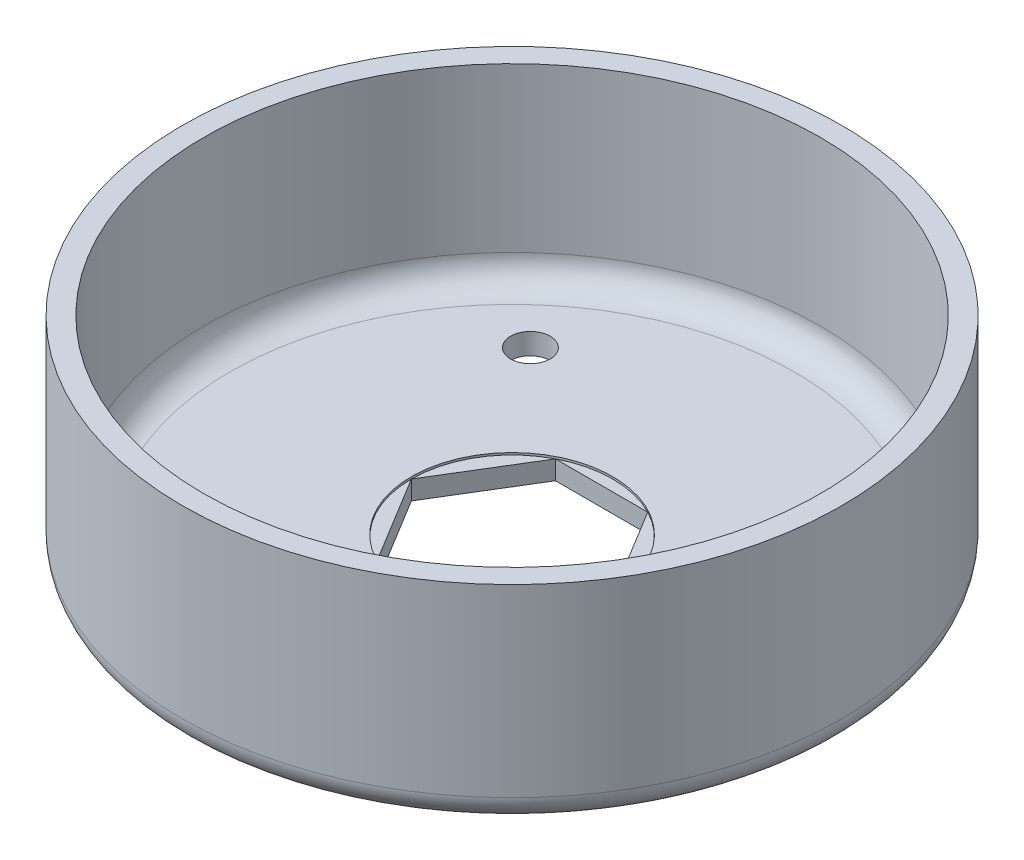
ISO-10303-21;
HEADER;
FILE_DESCRIPTION(('STEP AP214'),'2;1');
FILE_NAME('part.step','',(''),(''),'','','');
FILE_SCHEMA(('AUTOMOTIVE_DESIGN { 1 0 10303 214 1 1 1 1 }'));
ENDSEC;
DATA;
#1=APPLICATION_CONTEXT('core data for automotive mechanical design processes');
#2=APPLICATION_PROTOCOL_DEFINITION('international standard','automotive_design',2000,#1);
#3=PRODUCT_CONTEXT('',#1,'mechanical');
#4=PRODUCT('Part','Part','',(#3));
#5=PRODUCT_RELATED_PRODUCT_CATEGORY('part','',(#4));
#6=PRODUCT_DEFINITION_FORMATION('','',#4);
#7=PRODUCT_DEFINITION_CONTEXT('part definition',#1,'design');
#8=PRODUCT_DEFINITION('design','',#6,#7);
#9=PRODUCT_DEFINITION_SHAPE('','',#8);
#10=(LENGTH_UNIT() NAMED_UNIT(*) SI_UNIT(.MILLI.,.METRE.));
#11=(NAMED_UNIT(*) PLANE_ANGLE_UNIT() SI_UNIT($,.RADIAN.));
#12=(NAMED_UNIT(*) SI_UNIT($,.STERADIAN.) SOLID_ANGLE_UNIT());
#13=UNCERTAINTY_MEASURE_WITH_UNIT(LENGTH_MEASURE(1.E-05),#10,'distance_accuracy_value','');
#14=(GEOMETRIC_REPRESENTATION_CONTEXT(3) GLOBAL_UNCERTAINTY_ASSIGNED_CONTEXT((#13)) GLOBAL_UNIT_ASSIGNED_CONTEXT((#10,
#11,#12)) REPRESENTATION_CONTEXT('',''));
#15=CARTESIAN_POINT('',(0.,0.,0.));
#16=DIRECTION('',(0.,0.,1.));
#17=DIRECTION('',(1.,0.,0.));
#18=AXIS2_PLACEMENT_3D('',#15,#16,#17);
#19=CARTESIAN_POINT('',(-12.1245670639665,0.,0.));
#20=DIRECTION('',(-0.853892202059706,0.,-0.520449908503812));
#21=DIRECTION('',(-0.520449908503812,0.,0.853892202059706));
#22=AXIS2_PLACEMENT_3D('',#19,#20,#21);
#23=PLANE('',#22);
#24=DIRECTION('',(0.520449908503812,0.,-0.853892202059706));
#25=VECTOR('',#24,1.);
#26=CARTESIAN_POINT('',(-12.1245670639665,2.286,0.));
#27=LINE('',#26,#25);
#28=CARTESIAN_POINT('',(-12.1245670639665,2.286,0.));
#29=VERTEX_POINT('',#28);
#30=CARTESIAN_POINT('',(-5.55625,2.286,-10.7765120714507));
#31=VERTEX_POINT('',#30);
#32=EDGE_CURVE('E250',#29,#31,#27,.T.);
#33=ORIENTED_EDGE('',*,*,#32,.F.);
#34=DIRECTION('',(0.,1.,0.));
#35=VECTOR('',#34,1.);
#36=CARTESIAN_POINT('',(-12.1245670639665,0.,0.));
#37=LINE('',#36,#35);
#38=CARTESIAN_POINT('',(-12.1245670639665,0.,0.));
#39=VERTEX_POINT('',#38);
#40=EDGE_CURVE('E125',#39,#29,#37,.T.);
#41=ORIENTED_EDGE('',*,*,#40,.F.);
#42=DIRECTION('',(-0.520449908503812,0.,0.853892202059706));
#43=VECTOR('',#42,1.);
#44=CARTESIAN_POINT('',(-12.1245670639665,0.,0.));
#45=LINE('',#44,#43);
#46=CARTESIAN_POINT('',(-5.55625,0.,-10.7765120714507));
#47=VERTEX_POINT('',#46);
#48=EDGE_CURVE('E235',#47,#39,#45,.T.);
#49=ORIENTED_EDGE('',*,*,#48,.F.);
#50=DIRECTION('',(0.,1.,0.));
#51=VECTOR('',#50,1.);
#52=CARTESIAN_POINT('',(-5.55625,0.,-10.7765120714507));
#53=LINE('',#52,#51);
#54=EDGE_CURVE('E136',#47,#31,#53,.T.);
#55=ORIENTED_EDGE('',*,*,#54,.T.);
#56=EDGE_LOOP('',(#33,#41,#49,#55));
#57=FACE_BOUND('',#56,.T.);
#58=ADVANCED_FACE('F34',(#57),#23,.F.);
#59=CARTESIAN_POINT('',(-5.55625,0.,-10.7765120714507));
#60=DIRECTION('',(0.,0.,-1.));
#61=DIRECTION('',(-1.,0.,0.));
#62=AXIS2_PLACEMENT_3D('',#59,#60,#61);
#63=PLANE('',#62);
#64=DIRECTION('',(1.,0.,0.));
#65=VECTOR('',#64,1.);
#66=CARTESIAN_POINT('',(-5.55625,2.286,-10.7765120714507));
#67=LINE('',#66,#65);
#68=CARTESIAN_POINT('',(5.55625,2.286,-10.7765120714507));
#69=VERTEX_POINT('',#68);
#70=EDGE_CURVE('E245',#31,#69,#67,.T.);
#71=ORIENTED_EDGE('',*,*,#70,.F.);
#72=ORIENTED_EDGE('',*,*,#54,.F.);
#73=DIRECTION('',(-1.,0.,0.));
#74=VECTOR('',#73,1.);
#75=CARTESIAN_POINT('',(-5.55625,0.,-10.7765120714507));
#76=LINE('',#75,#74);
#77=CARTESIAN_POINT('',(5.55625,0.,-10.7765120714507));
#78=VERTEX_POINT('',#77);
#79=EDGE_CURVE('E131',#78,#47,#76,.T.);
#80=ORIENTED_EDGE('',*,*,#79,.F.);
#81=DIRECTION('',(0.,1.,0.));
#82=VECTOR('',#81,1.);
#83=CARTESIAN_POINT('',(5.55625,0.,-10.7765120714507));
#84=LINE('',#83,#82);
#85=EDGE_CURVE('E123',#78,#69,#84,.T.);
#86=ORIENTED_EDGE('',*,*,#85,.T.);
#87=EDGE_LOOP('',(#71,#72,#80,#86));
#88=FACE_BOUND('',#87,.T.);
#89=ADVANCED_FACE('F176',(#88),#63,.F.);
#90=CARTESIAN_POINT('',(5.55625,0.,-10.7765120714507));
#91=DIRECTION('',(0.853892202059706,0.,-0.520449908503812));
#92=DIRECTION('',(-0.520449908503812,0.,-0.853892202059706));
#93=AXIS2_PLACEMENT_3D('',#90,#91,#92);
#94=PLANE('',#93);
#95=DIRECTION('',(0.520449908503812,0.,0.853892202059706));
#96=VECTOR('',#95,1.);
#97=CARTESIAN_POINT('',(5.55625,2.286,-10.7765120714507));
#98=LINE('',#97,#96);
#99=CARTESIAN_POINT('',(12.1245670639665,2.286,0.));
#100=VERTEX_POINT('',#99);
#101=EDGE_CURVE('E96',#69,#100,#98,.T.);
#102=ORIENTED_EDGE('',*,*,#101,.F.);
#103=ORIENTED_EDGE('',*,*,#85,.F.);
#104=DIRECTION('',(-0.520449908503812,0.,-0.853892202059706));
#105=VECTOR('',#104,1.);
#106=CARTESIAN_POINT('',(5.55625,0.,-10.7765120714507));
#107=LINE('',#106,#105);
#108=CARTESIAN_POINT('',(12.1245670639665,0.,0.));
#109=VERTEX_POINT('',#108);
#110=EDGE_CURVE('E237',#109,#78,#107,.T.);
#111=ORIENTED_EDGE('',*,*,#110,.F.);
#112=DIRECTION('',(0.,1.,0.));
#113=VECTOR('',#112,1.);
#114=CARTESIAN_POINT('',(12.1245670639665,0.,0.));
#115=LINE('',#114,#113);
#116=EDGE_CURVE('E121',#109,#100,#115,.T.);
#117=ORIENTED_EDGE('',*,*,#116,.T.);
#118=EDGE_LOOP('',(#102,#103,#111,#117));
#119=FACE_BOUND('',#118,.T.);
#120=ADVANCED_FACE('F182',(#119),#94,.F.);
#121=CARTESIAN_POINT('',(12.1245670639665,0.,0.));
#122=DIRECTION('',(0.853892202059706,0.,0.520449908503812));
#123=DIRECTION('',(0.520449908503812,0.,-0.853892202059706));
#124=AXIS2_PLACEMENT_3D('',#121,#122,#123);
#125=PLANE('',#124);
#126=DIRECTION('',(-0.520449908503812,0.,0.853892202059706));
#127=VECTOR('',#126,1.);
#128=CARTESIAN_POINT('',(12.1245670639665,2.286,0.));
#129=LINE('',#128,#127);
#130=CARTESIAN_POINT('',(5.55625,2.286,10.7765120714507));
#131=VERTEX_POINT('',#130);
#132=EDGE_CURVE('E88',#100,#131,#129,.T.);
#133=ORIENTED_EDGE('',*,*,#132,.F.);
#134=ORIENTED_EDGE('',*,*,#116,.F.);
#135=DIRECTION('',(0.520449908503812,0.,-0.853892202059706));
#136=VECTOR('',#135,1.);
#137=CARTESIAN_POINT('',(12.1245670639665,0.,0.));
#138=LINE('',#137,#136);
#139=CARTESIAN_POINT('',(5.55625,0.,10.7765120714507));
#140=VERTEX_POINT('',#139);
#141=EDGE_CURVE('E120',#140,#109,#138,.T.);
#142=ORIENTED_EDGE('',*,*,#141,.F.);
#143=DIRECTION('',(0.,1.,0.));
#144=VECTOR('',#143,1.);
#145=CARTESIAN_POINT('',(5.55625,0.,10.7765120714507));
#146=LINE('',#145,#144);
#147=EDGE_CURVE('E114',#140,#131,#146,.T.);
#148=ORIENTED_EDGE('',*,*,#147,.T.);
#149=EDGE_LOOP('',(#133,#134,#142,#148));
#150=FACE_BOUND('',#149,.T.);
#151=ADVANCED_FACE('F118',(#150),#125,.F.);
#152=CARTESIAN_POINT('',(5.55625,0.,10.7765120714507));
#153=DIRECTION('',(0.,0.,1.));
#154=DIRECTION('',(1.,0.,0.));
#155=AXIS2_PLACEMENT_3D('',#152,#153,#154);
#156=PLANE('',#155);
#157=DIRECTION('',(-1.,0.,0.));
#158=VECTOR('',#157,1.);
#159=CARTESIAN_POINT('',(5.55625,2.286,10.7765120714507));
#160=LINE('',#159,#158);
#161=CARTESIAN_POINT('',(-5.55625,2.286,10.7765120714507));
#162=VERTEX_POINT('',#161);
#163=EDGE_CURVE('E97',#131,#162,#160,.T.);
#164=ORIENTED_EDGE('',*,*,#163,.F.);
#165=ORIENTED_EDGE('',*,*,#147,.F.);
#166=DIRECTION('',(1.,0.,0.));
#167=VECTOR('',#166,1.);
#168=CARTESIAN_POINT('',(5.55625,0.,10.7765120714507));
#169=LINE('',#168,#167);
#170=CARTESIAN_POINT('',(-5.55625,0.,10.7765120714507));
#171=VERTEX_POINT('',#170);
#172=EDGE_CURVE('E56',#171,#140,#169,.T.);
#173=ORIENTED_EDGE('',*,*,#172,.F.);
#174=DIRECTION('',(0.,1.,0.));
#175=VECTOR('',#174,1.);
#176=CARTESIAN_POINT('',(-5.55625,0.,10.7765120714507));
#177=LINE('',#176,#175);
#178=EDGE_CURVE('E116',#171,#162,#177,.T.);
#179=ORIENTED_EDGE('',*,*,#178,.T.);
#180=EDGE_LOOP('',(#164,#165,#173,#179));
#181=FACE_BOUND('',#180,.T.);
#182=ADVANCED_FACE('F113',(#181),#156,.F.);
#183=CARTESIAN_POINT('',(-5.55625,0.,10.7765120714507));
#184=DIRECTION('',(-0.853892202059706,0.,0.520449908503812));
#185=DIRECTION('',(0.520449908503812,0.,0.853892202059706));
#186=AXIS2_PLACEMENT_3D('',#183,#184,#185);
#187=PLANE('',#186);
#188=DIRECTION('',(-0.520449908503812,0.,-0.853892202059706));
#189=VECTOR('',#188,1.);
#190=CARTESIAN_POINT('',(-5.55625,2.286,10.7765120714507));
#191=LINE('',#190,#189);
#192=EDGE_CURVE('E139',#162,#29,#191,.T.);
#193=ORIENTED_EDGE('',*,*,#192,.F.);
#194=ORIENTED_EDGE('',*,*,#178,.F.);
#195=DIRECTION('',(0.520449908503812,0.,0.853892202059706));
#196=VECTOR('',#195,1.);
#197=CARTESIAN_POINT('',(-5.55625,0.,10.7765120714507));
#198=LINE('',#197,#196);
#199=EDGE_CURVE('E255',#39,#171,#198,.T.);
#200=ORIENTED_EDGE('',*,*,#199,.F.);
#201=ORIENTED_EDGE('',*,*,#40,.T.);
#202=EDGE_LOOP('',(#193,#194,#200,#201));
#203=FACE_BOUND('',#202,.T.);
#204=ADVANCED_FACE('F188',(#203),#187,.F.);
#205=CARTESIAN_POINT('',(0.,25.4,0.));
#206=DIRECTION('',(0.,-1.,0.));
#207=DIRECTION('',(0.,0.,-1.));
#208=AXIS2_PLACEMENT_3D('',#205,#206,#207);
#209=CYLINDRICAL_SURFACE('',#208,39.6875);
#210=CARTESIAN_POINT('',(0.,3.175,0.));
#211=DIRECTION('',(0.,1.,0.));
#212=DIRECTION('',(0.,0.,1.));
#213=AXIS2_PLACEMENT_3D('',#210,#211,#212);
#214=CIRCLE('',#213,39.6875);
#215=CARTESIAN_POINT('',(0.,3.175,39.6875));
#216=VERTEX_POINT('',#215);
#217=EDGE_CURVE('E141',#216,#216,#214,.T.);
#218=ORIENTED_EDGE('',*,*,#217,.T.);
#219=EDGE_LOOP('',(#218));
#220=FACE_BOUND('',#219,.T.);
#221=CARTESIAN_POINT('',(0.,25.4,0.));
#222=DIRECTION('',(0.,1.,0.));
#223=DIRECTION('',(0.,0.,1.));
#224=AXIS2_PLACEMENT_3D('',#221,#222,#223);
#225=CIRCLE('',#224,39.6875);
#226=CARTESIAN_POINT('',(0.,25.4,39.6875));
#227=VERTEX_POINT('',#226);
#228=EDGE_CURVE('E135',#227,#227,#225,.T.);
#229=ORIENTED_EDGE('',*,*,#228,.F.);
#230=EDGE_LOOP('',(#229));
#231=FACE_BOUND('',#230,.T.);
#232=ADVANCED_FACE('F200',(#220,#231),#209,.T.);
#233=CARTESIAN_POINT('',(0.,25.4,0.));
#234=DIRECTION('',(0.,1.,0.));
#235=DIRECTION('',(0.,0.,1.));
#236=AXIS2_PLACEMENT_3D('',#233,#234,#235);
#237=PLANE('',#236);
#238=CARTESIAN_POINT('',(0.,25.4,0.));
#239=DIRECTION('',(0.,1.,0.));
#240=DIRECTION('',(0.,0.,1.));
#241=AXIS2_PLACEMENT_3D('',#238,#239,#240);
#242=CIRCLE('',#241,37.1475);
#243=CARTESIAN_POINT('',(0.,25.4,37.1475));
#244=VERTEX_POINT('',#243);
#245=EDGE_CURVE('E132',#244,#244,#242,.T.);
#246=ORIENTED_EDGE('',*,*,#245,.F.);
#247=EDGE_LOOP('',(#246));
#248=FACE_BOUND('',#247,.T.);
#249=ORIENTED_EDGE('',*,*,#228,.T.);
#250=EDGE_LOOP('',(#249));
#251=FACE_BOUND('',#250,.T.);
#252=ADVANCED_FACE('F197',(#248,#251),#237,.T.);
#253=CARTESIAN_POINT('',(0.,0.,0.));
#254=DIRECTION('',(0.,1.,0.));
#255=DIRECTION('',(0.,0.,1.));
#256=AXIS2_PLACEMENT_3D('',#253,#254,#255);
#257=PLANE('',#256);
#258=CARTESIAN_POINT('',(19.8667853255919,0.,-17.1265120714507));
#259=DIRECTION('',(0.,-1.,0.));
#260=DIRECTION('',(0.,0.,-1.));
#261=AXIS2_PLACEMENT_3D('',#258,#259,#260);
#262=CIRCLE('',#261,2.38125);
#263=CARTESIAN_POINT('',(19.8667853255919,0.,-19.5077620714507));
#264=VERTEX_POINT('',#263);
#265=EDGE_CURVE('E434',#264,#264,#262,.T.);
#266=ORIENTED_EDGE('',*,*,#265,.F.);
#267=EDGE_LOOP('',(#266));
#268=FACE_BOUND('',#267,.T.);
#269=CARTESIAN_POINT('',(-18.4131181066461,0.,-20.6190120714507));
#270=DIRECTION('',(0.,-1.,0.));
#271=DIRECTION('',(0.,0.,-1.));
#272=AXIS2_PLACEMENT_3D('',#269,#270,#271);
#273=CIRCLE('',#272,2.38125);
#274=CARTESIAN_POINT('',(-18.4131181066461,0.,-23.0002620714507));
#275=VERTEX_POINT('',#274);
#276=EDGE_CURVE('E430',#275,#275,#273,.T.);
#277=ORIENTED_EDGE('',*,*,#276,.F.);
#278=EDGE_LOOP('',(#277));
#279=FACE_BOUND('',#278,.T.);
#280=CARTESIAN_POINT('',(-18.4131181066461,0.,20.6190120714507));
#281=DIRECTION('',(0.,-1.,0.));
#282=DIRECTION('',(0.,0.,-1.));
#283=AXIS2_PLACEMENT_3D('',#280,#281,#282);
#284=CIRCLE('',#283,2.38125);
#285=CARTESIAN_POINT('',(-18.4131181066461,0.,18.2377620714507));
#286=VERTEX_POINT('',#285);
#287=EDGE_CURVE('E428',#286,#286,#284,.T.);
#288=ORIENTED_EDGE('',*,*,#287,.F.);
#289=EDGE_LOOP('',(#288));
#290=FACE_BOUND('',#289,.T.);
#291=CARTESIAN_POINT('',(19.8667853255919,0.,20.6190120714507));
#292=DIRECTION('',(0.,-1.,0.));
#293=DIRECTION('',(0.,0.,-1.));
#294=AXIS2_PLACEMENT_3D('',#291,#292,#293);
#295=CIRCLE('',#294,2.38125);
#296=CARTESIAN_POINT('',(19.8667853255919,0.,18.2377620714507));
#297=VERTEX_POINT('',#296);
#298=EDGE_CURVE('E151',#297,#297,#295,.T.);
#299=ORIENTED_EDGE('',*,*,#298,.F.);
#300=EDGE_LOOP('',(#299));
#301=FACE_BOUND('',#300,.T.);
#302=CARTESIAN_POINT('',(0.,0.,0.));
#303=DIRECTION('',(0.,1.,0.));
#304=DIRECTION('',(0.,0.,1.));
#305=AXIS2_PLACEMENT_3D('',#302,#303,#304);
#306=CIRCLE('',#305,36.5125);
#307=CARTESIAN_POINT('',(0.,0.,36.5125));
#308=VERTEX_POINT('',#307);
#309=EDGE_CURVE('E144',#308,#308,#306,.F.);
#310=ORIENTED_EDGE('',*,*,#309,.T.);
#311=EDGE_LOOP('',(#310));
#312=FACE_BOUND('',#311,.T.);
#313=ORIENTED_EDGE('',*,*,#79,.T.);
#314=ORIENTED_EDGE('',*,*,#48,.T.);
#315=ORIENTED_EDGE('',*,*,#199,.T.);
#316=ORIENTED_EDGE('',*,*,#172,.T.);
#317=ORIENTED_EDGE('',*,*,#141,.T.);
#318=ORIENTED_EDGE('',*,*,#110,.T.);
#319=EDGE_LOOP('',(#313,#314,#315,#316,#317,#318));
#320=FACE_BOUND('',#319,.T.);
#321=ADVANCED_FACE('F193',(#268,#279,#290,#301,#312,#320),#257,.F.);
#322=CARTESIAN_POINT('',(0.,25.4,0.));
#323=DIRECTION('',(0.,-1.,0.));
#324=DIRECTION('',(0.,0.,-1.));
#325=AXIS2_PLACEMENT_3D('',#322,#323,#324);
#326=CYLINDRICAL_SURFACE('',#325,37.1475);
#327=CARTESIAN_POINT('',(0.,5.715,0.));
#328=DIRECTION('',(0.,1.,0.));
#329=DIRECTION('',(0.,0.,1.));
#330=AXIS2_PLACEMENT_3D('',#327,#328,#329);
#331=CIRCLE('',#330,37.1475);
#332=CARTESIAN_POINT('',(0.,5.715,37.1475));
#333=VERTEX_POINT('',#332);
#334=EDGE_CURVE('E11',#333,#333,#331,.F.);
#335=ORIENTED_EDGE('',*,*,#334,.T.);
#336=EDGE_LOOP('',(#335));
#337=FACE_BOUND('',#336,.T.);
#338=ORIENTED_EDGE('',*,*,#245,.T.);
#339=EDGE_LOOP('',(#338));
#340=FACE_BOUND('',#339,.T.);
#341=ADVANCED_FACE('F190',(#337,#340),#326,.F.);
#342=CARTESIAN_POINT('',(0.,2.54,0.));
#343=DIRECTION('',(0.,1.,0.));
#344=DIRECTION('',(0.,0.,1.));
#345=AXIS2_PLACEMENT_3D('',#342,#343,#344);
#346=PLANE('',#345);
#347=CARTESIAN_POINT('',(0.,2.54,0.));
#348=DIRECTION('',(0.,1.,0.));
#349=DIRECTION('',(0.,0.,1.));
#350=AXIS2_PLACEMENT_3D('',#347,#348,#349);
#351=CIRCLE('',#350,33.9725);
#352=CARTESIAN_POINT('',(0.,2.54,33.9725));
#353=VERTEX_POINT('',#352);
#354=EDGE_CURVE('E42',#353,#353,#351,.T.);
#355=ORIENTED_EDGE('',*,*,#354,.T.);
#356=EDGE_LOOP('',(#355));
#357=FACE_BOUND('',#356,.T.);
#358=CARTESIAN_POINT('',(19.8667853255919,2.54,-17.1265120714507));
#359=DIRECTION('',(0.,1.,0.));
#360=DIRECTION('',(0.,0.,1.));
#361=AXIS2_PLACEMENT_3D('',#358,#359,#360);
#362=CIRCLE('',#361,2.38125);
#363=CARTESIAN_POINT('',(19.8667853255919,2.54,-14.7452620714507));
#364=VERTEX_POINT('',#363);
#365=EDGE_CURVE('E157',#364,#364,#362,.T.);
#366=ORIENTED_EDGE('',*,*,#365,.F.);
#367=EDGE_LOOP('',(#366));
#368=FACE_BOUND('',#367,.T.);
#369=CARTESIAN_POINT('',(-18.4131181066461,2.54,-20.6190120714507));
#370=DIRECTION('',(0.,1.,0.));
#371=DIRECTION('',(0.,0.,1.));
#372=AXIS2_PLACEMENT_3D('',#369,#370,#371);
#373=CIRCLE('',#372,2.38125);
#374=CARTESIAN_POINT('',(-18.4131181066461,2.54,-18.2377620714507));
#375=VERTEX_POINT('',#374);
#376=EDGE_CURVE('E154',#375,#375,#373,.T.);
#377=ORIENTED_EDGE('',*,*,#376,.F.);
#378=EDGE_LOOP('',(#377));
#379=FACE_BOUND('',#378,.T.);
#380=CARTESIAN_POINT('',(-18.4131181066461,2.54,20.6190120714507));
#381=DIRECTION('',(0.,1.,0.));
#382=DIRECTION('',(0.,0.,1.));
#383=AXIS2_PLACEMENT_3D('',#380,#381,#382);
#384=CIRCLE('',#383,2.38125);
#385=CARTESIAN_POINT('',(-18.4131181066461,2.54,23.0002620714507));
#386=VERTEX_POINT('',#385);
#387=EDGE_CURVE('E150',#386,#386,#384,.T.);
#388=ORIENTED_EDGE('',*,*,#387,.F.);
#389=EDGE_LOOP('',(#388));
#390=FACE_BOUND('',#389,.T.);
#391=CARTESIAN_POINT('',(19.8667853255919,2.54,20.6190120714507));
#392=DIRECTION('',(0.,1.,0.));
#393=DIRECTION('',(0.,0.,1.));
#394=AXIS2_PLACEMENT_3D('',#391,#392,#393);
#395=CIRCLE('',#394,2.38125);
#396=CARTESIAN_POINT('',(19.8667853255919,2.54,23.0002620714507));
#397=VERTEX_POINT('',#396);
#398=EDGE_CURVE('E147',#397,#397,#395,.T.);
#399=ORIENTED_EDGE('',*,*,#398,.F.);
#400=EDGE_LOOP('',(#399));
#401=FACE_BOUND('',#400,.T.);
#402=CARTESIAN_POINT('',(0.,2.54,0.));
#403=DIRECTION('',(0.,1.,0.));
#404=DIRECTION('',(0.,0.,1.));
#405=AXIS2_PLACEMENT_3D('',#402,#403,#404);
#406=CIRCLE('',#405,12.1245670639665);
#407=CARTESIAN_POINT('',(0.,2.54,12.1245670639665));
#408=VERTEX_POINT('',#407);
#409=EDGE_CURVE('E106',#408,#408,#406,.T.);
#410=ORIENTED_EDGE('',*,*,#409,.F.);
#411=EDGE_LOOP('',(#410));
#412=FACE_BOUND('',#411,.T.);
#413=ADVANCED_FACE('F162',(#357,#368,#379,#390,#401,#412),#346,.T.);
#414=CARTESIAN_POINT('',(0.,2.286,0.));
#415=DIRECTION('',(0.,1.,0.));
#416=DIRECTION('',(0.,0.,1.));
#417=AXIS2_PLACEMENT_3D('',#414,#415,#416);
#418=CYLINDRICAL_SURFACE('',#417,12.1245670639665);
#419=ORIENTED_EDGE('',*,*,#409,.T.);
#420=EDGE_LOOP('',(#419));
#421=FACE_BOUND('',#420,.T.);
#422=CARTESIAN_POINT('',(0.,2.286,0.));
#423=DIRECTION('',(0.,1.,0.));
#424=DIRECTION('',(0.,0.,1.));
#425=AXIS2_PLACEMENT_3D('',#422,#423,#424);
#426=CIRCLE('',#425,12.1245670639665);
#427=EDGE_CURVE('E264',#69,#31,#426,.T.);
#428=ORIENTED_EDGE('',*,*,#427,.F.);
#429=EDGE_CURVE('E112',#100,#69,#426,.T.);
#430=ORIENTED_EDGE('',*,*,#429,.F.);
#431=EDGE_CURVE('E92',#131,#100,#426,.T.);
#432=ORIENTED_EDGE('',*,*,#431,.F.);
#433=EDGE_CURVE('E101',#162,#131,#426,.T.);
#434=ORIENTED_EDGE('',*,*,#433,.F.);
#435=EDGE_CURVE('E48',#29,#162,#426,.T.);
#436=ORIENTED_EDGE('',*,*,#435,.F.);
#437=EDGE_CURVE('E261',#31,#29,#426,.T.);
#438=ORIENTED_EDGE('',*,*,#437,.F.);
#439=EDGE_LOOP('',(#428,#430,#432,#434,#436,#438));
#440=FACE_BOUND('',#439,.T.);
#441=ADVANCED_FACE('F110',(#421,#440),#418,.F.);
#442=CARTESIAN_POINT('',(0.,2.286,0.));
#443=DIRECTION('',(0.,1.,0.));
#444=DIRECTION('',(0.,0.,1.));
#445=AXIS2_PLACEMENT_3D('',#442,#443,#444);
#446=PLANE('',#445);
#447=ORIENTED_EDGE('',*,*,#32,.T.);
#448=ORIENTED_EDGE('',*,*,#437,.T.);
#449=EDGE_LOOP('',(#447,#448));
#450=FACE_BOUND('',#449,.T.);
#451=ADVANCED_FACE('F220',(#450),#446,.T.);
#452=ORIENTED_EDGE('',*,*,#70,.T.);
#453=ORIENTED_EDGE('',*,*,#427,.T.);
#454=EDGE_LOOP('',(#452,#453));
#455=FACE_BOUND('',#454,.T.);
#456=ADVANCED_FACE('F277',(#455),#446,.T.);
#457=ORIENTED_EDGE('',*,*,#101,.T.);
#458=ORIENTED_EDGE('',*,*,#429,.T.);
#459=EDGE_LOOP('',(#457,#458));
#460=FACE_BOUND('',#459,.T.);
#461=ADVANCED_FACE('F363',(#460),#446,.T.);
#462=ORIENTED_EDGE('',*,*,#132,.T.);
#463=ORIENTED_EDGE('',*,*,#431,.T.);
#464=EDGE_LOOP('',(#462,#463));
#465=FACE_BOUND('',#464,.T.);
#466=ADVANCED_FACE('F90',(#465),#446,.T.);
#467=ORIENTED_EDGE('',*,*,#163,.T.);
#468=ORIENTED_EDGE('',*,*,#433,.T.);
#469=EDGE_LOOP('',(#467,#468));
#470=FACE_BOUND('',#469,.T.);
#471=ADVANCED_FACE('F102',(#470),#446,.T.);
#472=ORIENTED_EDGE('',*,*,#192,.T.);
#473=ORIENTED_EDGE('',*,*,#435,.T.);
#474=EDGE_LOOP('',(#472,#473));
#475=FACE_BOUND('',#474,.T.);
#476=ADVANCED_FACE('F210',(#475),#446,.T.);
#477=CARTESIAN_POINT('',(0.,3.175,0.));
#478=DIRECTION('',(0.,1.,0.));
#479=DIRECTION('',(0.,0.,1.));
#480=AXIS2_PLACEMENT_3D('',#477,#478,#479);
#481=TOROIDAL_SURFACE('',#480,36.5125,3.175);
#482=ORIENTED_EDGE('',*,*,#309,.F.);
#483=EDGE_LOOP('',(#482));
#484=FACE_BOUND('',#483,.T.);
#485=ORIENTED_EDGE('',*,*,#217,.F.);
#486=EDGE_LOOP('',(#485));
#487=FACE_BOUND('',#486,.T.);
#488=ADVANCED_FACE('F207',(#484,#487),#481,.T.);
#489=CARTESIAN_POINT('',(19.8667853255919,25.4,20.6190120714507));
#490=DIRECTION('',(0.,-1.,0.));
#491=DIRECTION('',(0.,0.,-1.));
#492=AXIS2_PLACEMENT_3D('',#489,#490,#491);
#493=CYLINDRICAL_SURFACE('',#492,2.38125);
#494=ORIENTED_EDGE('',*,*,#398,.T.);
#495=EDGE_LOOP('',(#494));
#496=FACE_BOUND('',#495,.T.);
#497=ORIENTED_EDGE('',*,*,#298,.T.);
#498=EDGE_LOOP('',(#497));
#499=FACE_BOUND('',#498,.T.);
#500=ADVANCED_FACE('F209',(#496,#499),#493,.F.);
#501=CARTESIAN_POINT('',(-18.4131181066461,25.4,20.6190120714507));
#502=DIRECTION('',(0.,-1.,0.));
#503=DIRECTION('',(0.,0.,-1.));
#504=AXIS2_PLACEMENT_3D('',#501,#502,#503);
#505=CYLINDRICAL_SURFACE('',#504,2.38125);
#506=ORIENTED_EDGE('',*,*,#387,.T.);
#507=EDGE_LOOP('',(#506));
#508=FACE_BOUND('',#507,.T.);
#509=ORIENTED_EDGE('',*,*,#287,.T.);
#510=EDGE_LOOP('',(#509));
#511=FACE_BOUND('',#510,.T.);
#512=ADVANCED_FACE('F216',(#508,#511),#505,.F.);
#513=CARTESIAN_POINT('',(-18.4131181066461,25.4,-20.6190120714507));
#514=DIRECTION('',(0.,-1.,0.));
#515=DIRECTION('',(0.,0.,-1.));
#516=AXIS2_PLACEMENT_3D('',#513,#514,#515);
#517=CYLINDRICAL_SURFACE('',#516,2.38125);
#518=ORIENTED_EDGE('',*,*,#376,.T.);
#519=EDGE_LOOP('',(#518));
#520=FACE_BOUND('',#519,.T.);
#521=ORIENTED_EDGE('',*,*,#276,.T.);
#522=EDGE_LOOP('',(#521));
#523=FACE_BOUND('',#522,.T.);
#524=ADVANCED_FACE('F171',(#520,#523),#517,.F.);
#525=CARTESIAN_POINT('',(19.8667853255919,25.4,-17.1265120714507));
#526=DIRECTION('',(0.,-1.,0.));
#527=DIRECTION('',(0.,0.,-1.));
#528=AXIS2_PLACEMENT_3D('',#525,#526,#527);
#529=CYLINDRICAL_SURFACE('',#528,2.38125);
#530=ORIENTED_EDGE('',*,*,#365,.T.);
#531=EDGE_LOOP('',(#530));
#532=FACE_BOUND('',#531,.T.);
#533=ORIENTED_EDGE('',*,*,#265,.T.);
#534=EDGE_LOOP('',(#533));
#535=FACE_BOUND('',#534,.T.);
#536=ADVANCED_FACE('F166',(#532,#535),#529,.F.);
#537=CARTESIAN_POINT('',(0.,5.715,0.));
#538=DIRECTION('',(0.,1.,0.));
#539=DIRECTION('',(0.,0.,1.));
#540=AXIS2_PLACEMENT_3D('',#537,#538,#539);
#541=TOROIDAL_SURFACE('',#540,33.9725,3.175);
#542=ORIENTED_EDGE('',*,*,#334,.F.);
#543=EDGE_LOOP('',(#542));
#544=FACE_BOUND('',#543,.T.);
#545=ORIENTED_EDGE('',*,*,#354,.F.);
#546=EDGE_LOOP('',(#545));
#547=FACE_BOUND('',#546,.T.);
#548=ADVANCED_FACE('F36',(#544,#547),#541,.F.);
#549=CLOSED_SHELL('',(#58,#89,#120,#151,#182,#204,#232,#252,#321,#341,#413,#441,#451,#456,#461,
#466,#471,#476,#488,#500,#512,#524,#536,#548));
#550=MANIFOLD_SOLID_BREP('B2',#549);
#551=ADVANCED_BREP_SHAPE_REPRESENTATION('',(#18,#550),#14);
#552=SHAPE_DEFINITION_REPRESENTATION(#9,#551);
ENDSEC;
END-ISO-10303-21;
